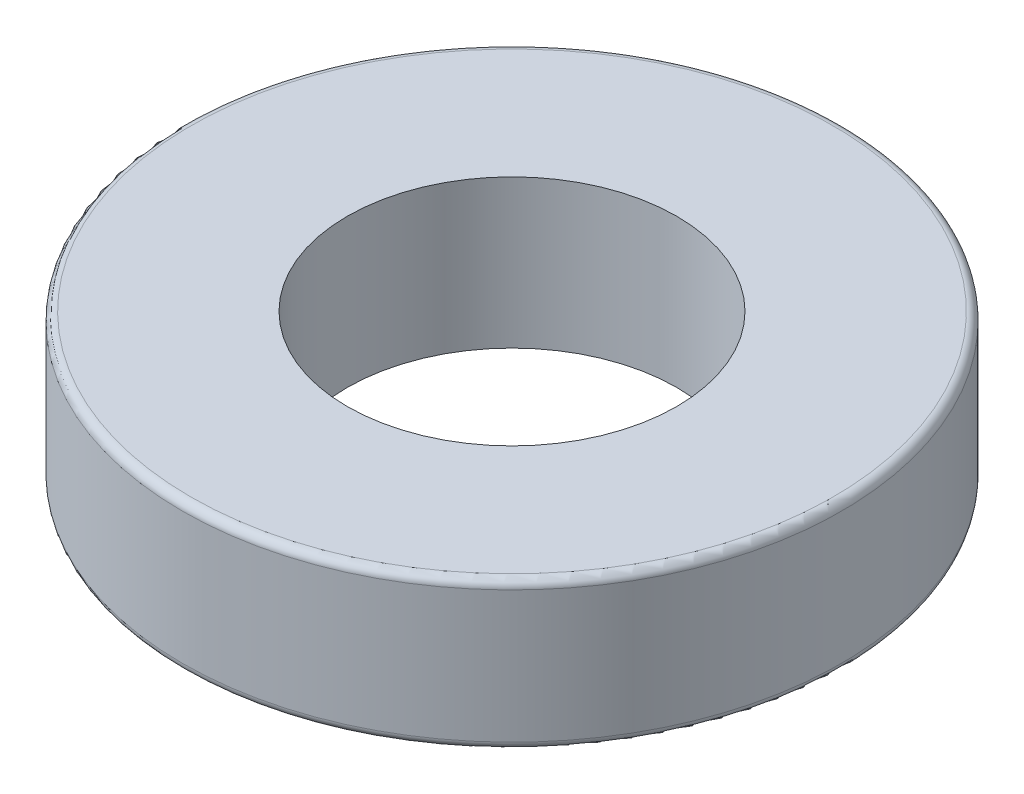
ISO-10303-21;
HEADER;
FILE_DESCRIPTION(('STEP AP214'),'2;1');
FILE_NAME('part.step','',(''),(''),'','','');
FILE_SCHEMA(('AUTOMOTIVE_DESIGN { 1 0 10303 214 1 1 1 1 }'));
ENDSEC;
DATA;
#1=APPLICATION_CONTEXT('core data for automotive mechanical design processes');
#2=APPLICATION_PROTOCOL_DEFINITION('international standard','automotive_design',2000,#1);
#3=PRODUCT_CONTEXT('',#1,'mechanical');
#4=PRODUCT('Part','Part','',(#3));
#5=PRODUCT_RELATED_PRODUCT_CATEGORY('part','',(#4));
#6=PRODUCT_DEFINITION_FORMATION('','',#4);
#7=PRODUCT_DEFINITION_CONTEXT('part definition',#1,'design');
#8=PRODUCT_DEFINITION('design','',#6,#7);
#9=PRODUCT_DEFINITION_SHAPE('','',#8);
#10=(LENGTH_UNIT() NAMED_UNIT(*) SI_UNIT(.MILLI.,.METRE.));
#11=(NAMED_UNIT(*) PLANE_ANGLE_UNIT() SI_UNIT($,.RADIAN.));
#12=(NAMED_UNIT(*) SI_UNIT($,.STERADIAN.) SOLID_ANGLE_UNIT());
#13=UNCERTAINTY_MEASURE_WITH_UNIT(LENGTH_MEASURE(1.E-05),#10,'distance_accuracy_value','');
#14=(GEOMETRIC_REPRESENTATION_CONTEXT(3) GLOBAL_UNCERTAINTY_ASSIGNED_CONTEXT((#13)) GLOBAL_UNIT_ASSIGNED_CONTEXT((#10,
#11,#12)) REPRESENTATION_CONTEXT('',''));
#15=CARTESIAN_POINT('',(0.,0.,0.));
#16=DIRECTION('',(0.,0.,1.));
#17=DIRECTION('',(1.,0.,0.));
#18=AXIS2_PLACEMENT_3D('',#15,#16,#17);
#19=CARTESIAN_POINT('',(0.,18.,0.));
#20=DIRECTION('',(0.,1.,0.));
#21=DIRECTION('',(0.,0.,1.));
#22=AXIS2_PLACEMENT_3D('',#19,#20,#21);
#23=PLANE('',#22);
#24=CARTESIAN_POINT('',(0.,18.,0.));
#25=DIRECTION('',(0.,1.,0.));
#26=DIRECTION('',(0.,0.,1.));
#27=AXIS2_PLACEMENT_3D('',#24,#25,#26);
#28=CIRCLE('',#27,39.);
#29=CARTESIAN_POINT('',(0.,18.,39.));
#30=VERTEX_POINT('',#29);
#31=EDGE_CURVE('E10',#30,#30,#28,.T.);
#32=ORIENTED_EDGE('',*,*,#31,.T.);
#33=EDGE_LOOP('',(#32));
#34=FACE_BOUND('',#33,.T.);
#35=CARTESIAN_POINT('',(0.,18.,0.));
#36=DIRECTION('',(0.,1.,0.));
#37=DIRECTION('',(0.,0.,1.));
#38=AXIS2_PLACEMENT_3D('',#35,#36,#37);
#39=CIRCLE('',#38,20.);
#40=CARTESIAN_POINT('',(0.,18.,20.));
#41=VERTEX_POINT('',#40);
#42=EDGE_CURVE('E51',#41,#41,#39,.T.);
#43=ORIENTED_EDGE('',*,*,#42,.F.);
#44=EDGE_LOOP('',(#43));
#45=FACE_BOUND('',#44,.T.);
#46=ADVANCED_FACE('F31',(#34,#45),#23,.T.);
#47=CARTESIAN_POINT('',(0.,0.,0.));
#48=DIRECTION('',(0.,1.,0.));
#49=DIRECTION('',(0.,0.,1.));
#50=AXIS2_PLACEMENT_3D('',#47,#48,#49);
#51=PLANE('',#50);
#52=CARTESIAN_POINT('',(0.,0.,0.));
#53=DIRECTION('',(0.,1.,0.));
#54=DIRECTION('',(0.,0.,1.));
#55=AXIS2_PLACEMENT_3D('',#52,#53,#54);
#56=CIRCLE('',#55,39.);
#57=CARTESIAN_POINT('',(0.,0.,39.));
#58=VERTEX_POINT('',#57);
#59=EDGE_CURVE('E38',#58,#58,#56,.F.);
#60=ORIENTED_EDGE('',*,*,#59,.T.);
#61=EDGE_LOOP('',(#60));
#62=FACE_BOUND('',#61,.T.);
#63=CARTESIAN_POINT('',(0.,0.,0.));
#64=DIRECTION('',(0.,1.,0.));
#65=DIRECTION('',(0.,0.,1.));
#66=AXIS2_PLACEMENT_3D('',#63,#64,#65);
#67=CIRCLE('',#66,20.);
#68=CARTESIAN_POINT('',(0.,0.,20.));
#69=VERTEX_POINT('',#68);
#70=EDGE_CURVE('E52',#69,#69,#67,.T.);
#71=ORIENTED_EDGE('',*,*,#70,.T.);
#72=EDGE_LOOP('',(#71));
#73=FACE_BOUND('',#72,.T.);
#74=ADVANCED_FACE('F62',(#62,#73),#51,.F.);
#75=CARTESIAN_POINT('',(0.,18.,0.));
#76=DIRECTION('',(0.,-1.,0.));
#77=DIRECTION('',(0.,0.,-1.));
#78=AXIS2_PLACEMENT_3D('',#75,#76,#77);
#79=CYLINDRICAL_SURFACE('',#78,40.);
#80=CARTESIAN_POINT('',(0.,1.,0.));
#81=DIRECTION('',(0.,1.,0.));
#82=DIRECTION('',(0.,0.,1.));
#83=AXIS2_PLACEMENT_3D('',#80,#81,#82);
#84=CIRCLE('',#83,40.);
#85=CARTESIAN_POINT('',(0.,1.,40.));
#86=VERTEX_POINT('',#85);
#87=EDGE_CURVE('E42',#86,#86,#84,.T.);
#88=ORIENTED_EDGE('',*,*,#87,.T.);
#89=EDGE_LOOP('',(#88));
#90=FACE_BOUND('',#89,.T.);
#91=CARTESIAN_POINT('',(0.,17.,0.));
#92=DIRECTION('',(0.,1.,0.));
#93=DIRECTION('',(0.,0.,1.));
#94=AXIS2_PLACEMENT_3D('',#91,#92,#93);
#95=CIRCLE('',#94,40.);
#96=CARTESIAN_POINT('',(0.,17.,40.));
#97=VERTEX_POINT('',#96);
#98=EDGE_CURVE('E46',#97,#97,#95,.F.);
#99=ORIENTED_EDGE('',*,*,#98,.T.);
#100=EDGE_LOOP('',(#99));
#101=FACE_BOUND('',#100,.T.);
#102=ADVANCED_FACE('F67',(#90,#101),#79,.T.);
#103=CARTESIAN_POINT('',(0.,18.,0.));
#104=DIRECTION('',(0.,-1.,0.));
#105=DIRECTION('',(0.,0.,-1.));
#106=AXIS2_PLACEMENT_3D('',#103,#104,#105);
#107=CYLINDRICAL_SURFACE('',#106,20.);
#108=ORIENTED_EDGE('',*,*,#42,.T.);
#109=EDGE_LOOP('',(#108));
#110=FACE_BOUND('',#109,.T.);
#111=ORIENTED_EDGE('',*,*,#70,.F.);
#112=EDGE_LOOP('',(#111));
#113=FACE_BOUND('',#112,.T.);
#114=ADVANCED_FACE('F58',(#110,#113),#107,.F.);
#115=CARTESIAN_POINT('',(0.,1.,0.));
#116=DIRECTION('',(0.,1.,0.));
#117=DIRECTION('',(0.,0.,1.));
#118=AXIS2_PLACEMENT_3D('',#115,#116,#117);
#119=TOROIDAL_SURFACE('',#118,39.,1.);
#120=ORIENTED_EDGE('',*,*,#59,.F.);
#121=EDGE_LOOP('',(#120));
#122=FACE_BOUND('',#121,.T.);
#123=ORIENTED_EDGE('',*,*,#87,.F.);
#124=EDGE_LOOP('',(#123));
#125=FACE_BOUND('',#124,.T.);
#126=ADVANCED_FACE('F73',(#122,#125),#119,.T.);
#127=CARTESIAN_POINT('',(0.,17.,0.));
#128=DIRECTION('',(0.,1.,0.));
#129=DIRECTION('',(0.,0.,1.));
#130=AXIS2_PLACEMENT_3D('',#127,#128,#129);
#131=TOROIDAL_SURFACE('',#130,39.,1.);
#132=ORIENTED_EDGE('',*,*,#98,.F.);
#133=EDGE_LOOP('',(#132));
#134=FACE_BOUND('',#133,.T.);
#135=ORIENTED_EDGE('',*,*,#31,.F.);
#136=EDGE_LOOP('',(#135));
#137=FACE_BOUND('',#136,.T.);
#138=ADVANCED_FACE('F33',(#134,#137),#131,.T.);
#139=CLOSED_SHELL('',(#46,#74,#102,#114,#126,#138));
#140=MANIFOLD_SOLID_BREP('B2',#139);
#141=ADVANCED_BREP_SHAPE_REPRESENTATION('',(#18,#140),#14);
#142=SHAPE_DEFINITION_REPRESENTATION(#9,#141);
ENDSEC;
END-ISO-10303-21;
